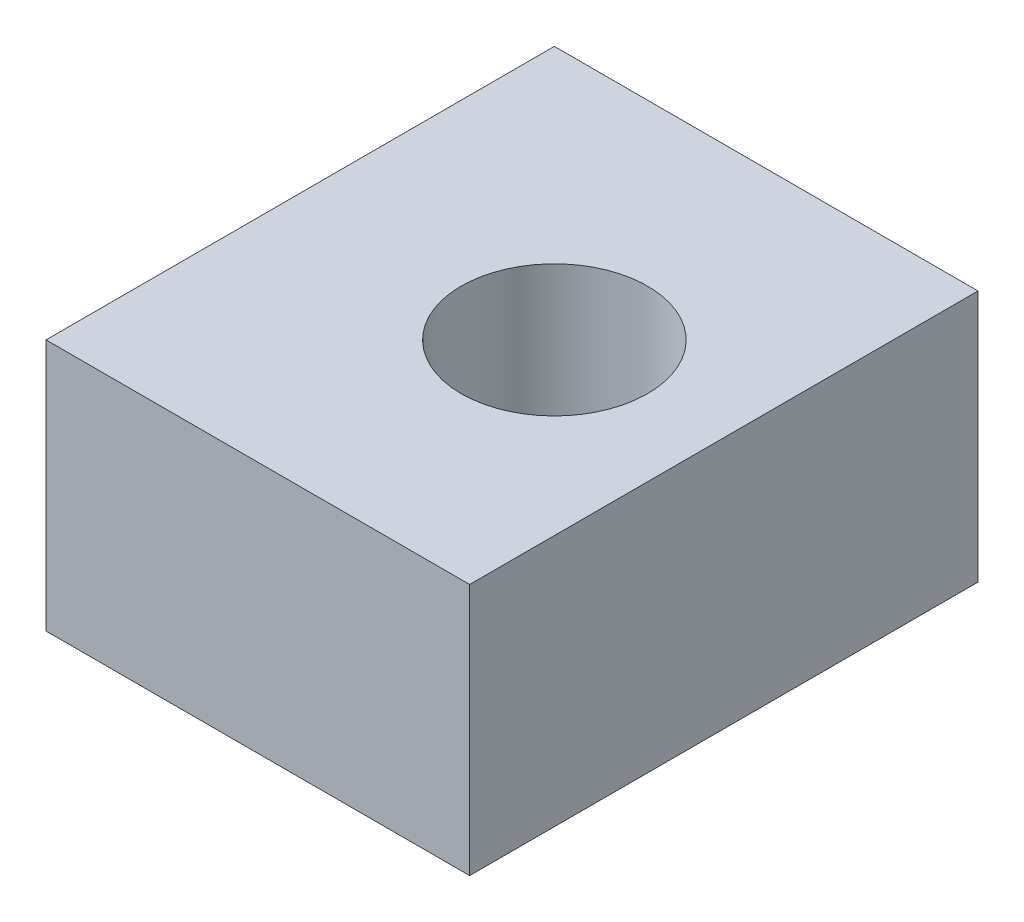
ISO-10303-21;
HEADER;
FILE_DESCRIPTION(('STEP AP214'),'2;1');
FILE_NAME('part.step','',(''),(''),'','','');
FILE_SCHEMA(('AUTOMOTIVE_DESIGN { 1 0 10303 214 1 1 1 1 }'));
ENDSEC;
DATA;
#1=APPLICATION_CONTEXT('core data for automotive mechanical design processes');
#2=APPLICATION_PROTOCOL_DEFINITION('international standard','automotive_design',2000,#1);
#3=PRODUCT_CONTEXT('',#1,'mechanical');
#4=PRODUCT('Part','Part','',(#3));
#5=PRODUCT_RELATED_PRODUCT_CATEGORY('part','',(#4));
#6=PRODUCT_DEFINITION_FORMATION('','',#4);
#7=PRODUCT_DEFINITION_CONTEXT('part definition',#1,'design');
#8=PRODUCT_DEFINITION('design','',#6,#7);
#9=PRODUCT_DEFINITION_SHAPE('','',#8);
#10=(LENGTH_UNIT() NAMED_UNIT(*) SI_UNIT(.MILLI.,.METRE.));
#11=(NAMED_UNIT(*) PLANE_ANGLE_UNIT() SI_UNIT($,.RADIAN.));
#12=(NAMED_UNIT(*) SI_UNIT($,.STERADIAN.) SOLID_ANGLE_UNIT());
#13=UNCERTAINTY_MEASURE_WITH_UNIT(LENGTH_MEASURE(1.E-05),#10,'distance_accuracy_value','');
#14=(GEOMETRIC_REPRESENTATION_CONTEXT(3) GLOBAL_UNCERTAINTY_ASSIGNED_CONTEXT((#13)) GLOBAL_UNIT_ASSIGNED_CONTEXT((#10,
#11,#12)) REPRESENTATION_CONTEXT('',''));
#15=CARTESIAN_POINT('',(0.,0.,0.));
#16=DIRECTION('',(0.,0.,1.));
#17=DIRECTION('',(1.,0.,0.));
#18=AXIS2_PLACEMENT_3D('',#15,#16,#17);
#19=CARTESIAN_POINT('',(0.,9.4488,0.));
#20=DIRECTION('',(0.,1.,0.));
#21=DIRECTION('',(0.,0.,1.));
#22=AXIS2_PLACEMENT_3D('',#19,#20,#21);
#23=PLANE('',#22);
#24=DIRECTION('',(0.,0.,1.));
#25=VECTOR('',#24,1.);
#26=CARTESIAN_POINT('',(-9.525,9.4488,-9.525));
#27=LINE('',#26,#25);
#28=CARTESIAN_POINT('',(-9.525,9.4488,-9.525));
#29=VERTEX_POINT('',#28);
#30=CARTESIAN_POINT('',(-9.525,9.4488,9.525));
#31=VERTEX_POINT('',#30);
#32=EDGE_CURVE('E85',#29,#31,#27,.T.);
#33=ORIENTED_EDGE('',*,*,#32,.T.);
#34=DIRECTION('',(1.,0.,0.));
#35=VECTOR('',#34,1.);
#36=CARTESIAN_POINT('',(-9.525,9.4488,9.525));
#37=LINE('',#36,#35);
#38=CARTESIAN_POINT('',(6.35,9.4488,9.525));
#39=VERTEX_POINT('',#38);
#40=EDGE_CURVE('E80',#31,#39,#37,.T.);
#41=ORIENTED_EDGE('',*,*,#40,.T.);
#42=DIRECTION('',(0.,0.,-1.));
#43=VECTOR('',#42,1.);
#44=CARTESIAN_POINT('',(6.35,9.4488,-9.525));
#45=LINE('',#44,#43);
#46=CARTESIAN_POINT('',(6.35,9.4488,-9.525));
#47=VERTEX_POINT('',#46);
#48=EDGE_CURVE('E83',#39,#47,#45,.T.);
#49=ORIENTED_EDGE('',*,*,#48,.T.);
#50=DIRECTION('',(-1.,0.,0.));
#51=VECTOR('',#50,1.);
#52=CARTESIAN_POINT('',(-9.525,9.4488,-9.525));
#53=LINE('',#52,#51);
#54=EDGE_CURVE('E50',#47,#29,#53,.T.);
#55=ORIENTED_EDGE('',*,*,#54,.T.);
#56=EDGE_LOOP('',(#33,#41,#49,#55));
#57=FACE_BOUND('',#56,.T.);
#58=CARTESIAN_POINT('',(0.,9.4488,0.));
#59=DIRECTION('',(0.,1.,0.));
#60=DIRECTION('',(0.,0.,1.));
#61=AXIS2_PLACEMENT_3D('',#58,#59,#60);
#62=CIRCLE('',#61,3.4925);
#63=CARTESIAN_POINT('',(0.,9.4488,3.4925));
#64=VERTEX_POINT('',#63);
#65=EDGE_CURVE('E100',#64,#64,#62,.T.);
#66=ORIENTED_EDGE('',*,*,#65,.F.);
#67=EDGE_LOOP('',(#66));
#68=FACE_BOUND('',#67,.T.);
#69=ADVANCED_FACE('F33',(#57,#68),#23,.T.);
#70=CARTESIAN_POINT('',(0.,0.,0.));
#71=DIRECTION('',(0.,1.,0.));
#72=DIRECTION('',(0.,0.,1.));
#73=AXIS2_PLACEMENT_3D('',#70,#71,#72);
#74=PLANE('',#73);
#75=DIRECTION('',(0.,0.,1.));
#76=VECTOR('',#75,1.);
#77=CARTESIAN_POINT('',(-9.525,0.,-9.525));
#78=LINE('',#77,#76);
#79=CARTESIAN_POINT('',(-9.525,0.,-9.525));
#80=VERTEX_POINT('',#79);
#81=CARTESIAN_POINT('',(-9.525,0.,9.525));
#82=VERTEX_POINT('',#81);
#83=EDGE_CURVE('E97',#80,#82,#78,.T.);
#84=ORIENTED_EDGE('',*,*,#83,.F.);
#85=DIRECTION('',(-1.,0.,0.));
#86=VECTOR('',#85,1.);
#87=CARTESIAN_POINT('',(-9.525,0.,-9.525));
#88=LINE('',#87,#86);
#89=CARTESIAN_POINT('',(6.35,0.,-9.525));
#90=VERTEX_POINT('',#89);
#91=EDGE_CURVE('E73',#90,#80,#88,.T.);
#92=ORIENTED_EDGE('',*,*,#91,.F.);
#93=DIRECTION('',(0.,0.,-1.));
#94=VECTOR('',#93,1.);
#95=CARTESIAN_POINT('',(6.35,0.,-9.525));
#96=LINE('',#95,#94);
#97=CARTESIAN_POINT('',(6.35,0.,9.525));
#98=VERTEX_POINT('',#97);
#99=EDGE_CURVE('E67',#98,#90,#96,.T.);
#100=ORIENTED_EDGE('',*,*,#99,.F.);
#101=DIRECTION('',(1.,0.,0.));
#102=VECTOR('',#101,1.);
#103=CARTESIAN_POINT('',(-9.525,0.,9.525));
#104=LINE('',#103,#102);
#105=EDGE_CURVE('E89',#82,#98,#104,.T.);
#106=ORIENTED_EDGE('',*,*,#105,.F.);
#107=EDGE_LOOP('',(#84,#92,#100,#106));
#108=FACE_BOUND('',#107,.T.);
#109=CARTESIAN_POINT('',(0.,0.,0.));
#110=DIRECTION('',(0.,1.,0.));
#111=DIRECTION('',(0.,0.,1.));
#112=AXIS2_PLACEMENT_3D('',#109,#110,#111);
#113=CIRCLE('',#112,3.4925);
#114=CARTESIAN_POINT('',(0.,0.,3.4925));
#115=VERTEX_POINT('',#114);
#116=EDGE_CURVE('E112',#115,#115,#113,.T.);
#117=ORIENTED_EDGE('',*,*,#116,.T.);
#118=EDGE_LOOP('',(#117));
#119=FACE_BOUND('',#118,.T.);
#120=ADVANCED_FACE('F108',(#108,#119),#74,.F.);
#121=CARTESIAN_POINT('',(-9.525,9.4488,-9.525));
#122=DIRECTION('',(1.,0.,0.));
#123=DIRECTION('',(0.,0.,-1.));
#124=AXIS2_PLACEMENT_3D('',#121,#122,#123);
#125=PLANE('',#124);
#126=ORIENTED_EDGE('',*,*,#83,.T.);
#127=DIRECTION('',(0.,-1.,0.));
#128=VECTOR('',#127,1.);
#129=CARTESIAN_POINT('',(-9.525,9.4488,9.525));
#130=LINE('',#129,#128);
#131=EDGE_CURVE('E11',#31,#82,#130,.T.);
#132=ORIENTED_EDGE('',*,*,#131,.F.);
#133=ORIENTED_EDGE('',*,*,#32,.F.);
#134=DIRECTION('',(0.,-1.,0.));
#135=VECTOR('',#134,1.);
#136=CARTESIAN_POINT('',(-9.525,9.4488,-9.525));
#137=LINE('',#136,#135);
#138=EDGE_CURVE('E93',#29,#80,#137,.T.);
#139=ORIENTED_EDGE('',*,*,#138,.T.);
#140=EDGE_LOOP('',(#126,#132,#133,#139));
#141=FACE_BOUND('',#140,.T.);
#142=ADVANCED_FACE('F35',(#141),#125,.F.);
#143=CARTESIAN_POINT('',(-9.525,9.4488,9.525));
#144=DIRECTION('',(0.,0.,-1.));
#145=DIRECTION('',(-1.,0.,0.));
#146=AXIS2_PLACEMENT_3D('',#143,#144,#145);
#147=PLANE('',#146);
#148=ORIENTED_EDGE('',*,*,#105,.T.);
#149=DIRECTION('',(0.,-1.,0.));
#150=VECTOR('',#149,1.);
#151=CARTESIAN_POINT('',(6.35,9.4488,9.525));
#152=LINE('',#151,#150);
#153=EDGE_CURVE('E42',#39,#98,#152,.T.);
#154=ORIENTED_EDGE('',*,*,#153,.F.);
#155=ORIENTED_EDGE('',*,*,#40,.F.);
#156=ORIENTED_EDGE('',*,*,#131,.T.);
#157=EDGE_LOOP('',(#148,#154,#155,#156));
#158=FACE_BOUND('',#157,.T.);
#159=ADVANCED_FACE('F88',(#158),#147,.F.);
#160=CARTESIAN_POINT('',(6.35,9.4488,-9.525));
#161=DIRECTION('',(-1.,0.,0.));
#162=DIRECTION('',(0.,0.,1.));
#163=AXIS2_PLACEMENT_3D('',#160,#161,#162);
#164=PLANE('',#163);
#165=ORIENTED_EDGE('',*,*,#99,.T.);
#166=DIRECTION('',(0.,-1.,0.));
#167=VECTOR('',#166,1.);
#168=CARTESIAN_POINT('',(6.35,9.4488,-9.525));
#169=LINE('',#168,#167);
#170=EDGE_CURVE('E90',#47,#90,#169,.T.);
#171=ORIENTED_EDGE('',*,*,#170,.F.);
#172=ORIENTED_EDGE('',*,*,#48,.F.);
#173=ORIENTED_EDGE('',*,*,#153,.T.);
#174=EDGE_LOOP('',(#165,#171,#172,#173));
#175=FACE_BOUND('',#174,.T.);
#176=ADVANCED_FACE('F91',(#175),#164,.F.);
#177=CARTESIAN_POINT('',(-9.525,9.4488,-9.525));
#178=DIRECTION('',(0.,0.,1.));
#179=DIRECTION('',(1.,0.,0.));
#180=AXIS2_PLACEMENT_3D('',#177,#178,#179);
#181=PLANE('',#180);
#182=ORIENTED_EDGE('',*,*,#91,.T.);
#183=ORIENTED_EDGE('',*,*,#138,.F.);
#184=ORIENTED_EDGE('',*,*,#54,.F.);
#185=ORIENTED_EDGE('',*,*,#170,.T.);
#186=EDGE_LOOP('',(#182,#183,#184,#185));
#187=FACE_BOUND('',#186,.T.);
#188=ADVANCED_FACE('F105',(#187),#181,.F.);
#189=CARTESIAN_POINT('',(0.,9.4488,0.));
#190=DIRECTION('',(0.,-1.,0.));
#191=DIRECTION('',(0.,0.,-1.));
#192=AXIS2_PLACEMENT_3D('',#189,#190,#191);
#193=CYLINDRICAL_SURFACE('',#192,3.4925);
#194=ORIENTED_EDGE('',*,*,#65,.T.);
#195=EDGE_LOOP('',(#194));
#196=FACE_BOUND('',#195,.T.);
#197=ORIENTED_EDGE('',*,*,#116,.F.);
#198=EDGE_LOOP('',(#197));
#199=FACE_BOUND('',#198,.T.);
#200=ADVANCED_FACE('F118',(#196,#199),#193,.F.);
#201=CLOSED_SHELL('',(#69,#120,#142,#159,#176,#188,#200));
#202=MANIFOLD_SOLID_BREP('B2',#201);
#203=ADVANCED_BREP_SHAPE_REPRESENTATION('',(#18,#202),#14);
#204=SHAPE_DEFINITION_REPRESENTATION(#9,#203);
ENDSEC;
END-ISO-10303-21;
